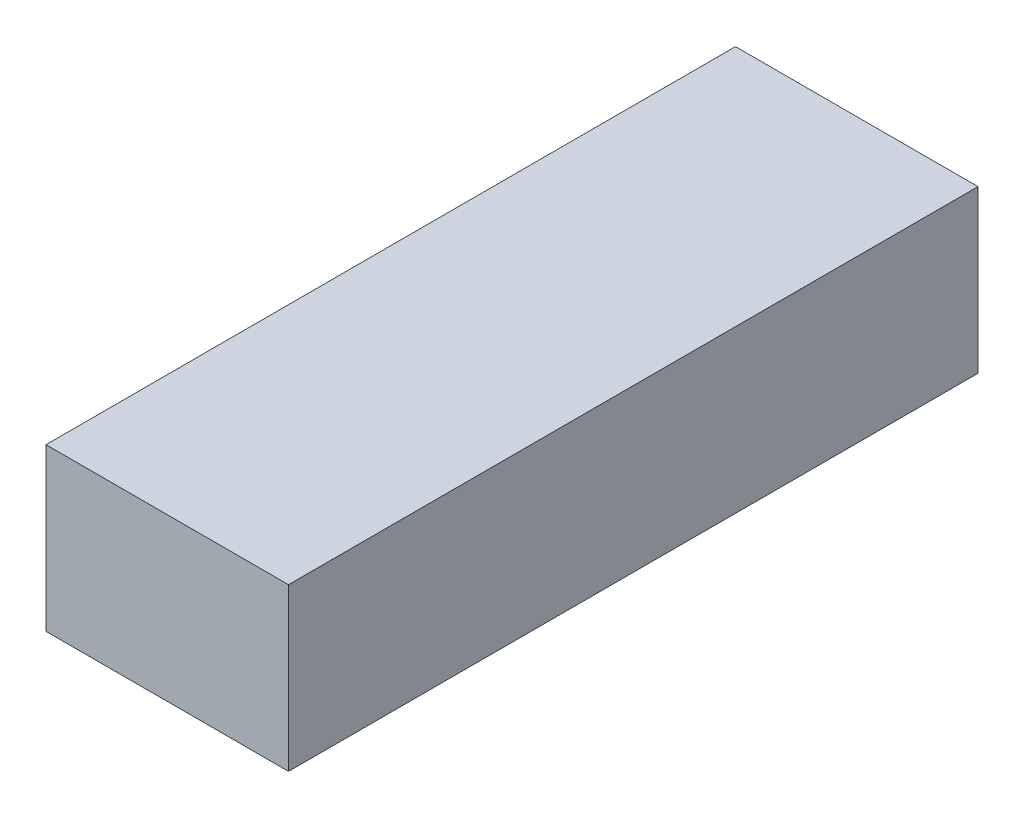
ISO-10303-21;
HEADER;
FILE_DESCRIPTION(('STEP AP214'),'2;1');
FILE_NAME('part.step','',(''),(''),'','','');
FILE_SCHEMA(('AUTOMOTIVE_DESIGN { 1 0 10303 214 1 1 1 1 }'));
ENDSEC;
DATA;
#1=APPLICATION_CONTEXT('core data for automotive mechanical design processes');
#2=APPLICATION_PROTOCOL_DEFINITION('international standard','automotive_design',2000,#1);
#3=PRODUCT_CONTEXT('',#1,'mechanical');
#4=PRODUCT('Part','Part','',(#3));
#5=PRODUCT_RELATED_PRODUCT_CATEGORY('part','',(#4));
#6=PRODUCT_DEFINITION_FORMATION('','',#4);
#7=PRODUCT_DEFINITION_CONTEXT('part definition',#1,'design');
#8=PRODUCT_DEFINITION('design','',#6,#7);
#9=PRODUCT_DEFINITION_SHAPE('','',#8);
#10=(LENGTH_UNIT() NAMED_UNIT(*) SI_UNIT(.MILLI.,.METRE.));
#11=(NAMED_UNIT(*) PLANE_ANGLE_UNIT() SI_UNIT($,.RADIAN.));
#12=(NAMED_UNIT(*) SI_UNIT($,.STERADIAN.) SOLID_ANGLE_UNIT());
#13=UNCERTAINTY_MEASURE_WITH_UNIT(LENGTH_MEASURE(1.E-05),#10,'distance_accuracy_value','');
#14=(GEOMETRIC_REPRESENTATION_CONTEXT(3) GLOBAL_UNCERTAINTY_ASSIGNED_CONTEXT((#13)) GLOBAL_UNIT_ASSIGNED_CONTEXT((#10,
#11,#12)) REPRESENTATION_CONTEXT('',''));
#15=CARTESIAN_POINT('',(0.,0.,0.));
#16=DIRECTION('',(0.,0.,1.));
#17=DIRECTION('',(1.,0.,0.));
#18=AXIS2_PLACEMENT_3D('',#15,#16,#17);
#19=CARTESIAN_POINT('',(25.5,-17.,145.));
#20=DIRECTION('',(-1.,0.,0.));
#21=DIRECTION('',(0.,0.,1.));
#22=AXIS2_PLACEMENT_3D('',#19,#20,#21);
#23=PLANE('',#22);
#24=DIRECTION('',(0.,1.,0.));
#25=VECTOR('',#24,1.);
#26=CARTESIAN_POINT('',(25.5,-17.,0.));
#27=LINE('',#26,#25);
#28=CARTESIAN_POINT('',(25.5,-17.,0.));
#29=VERTEX_POINT('',#28);
#30=CARTESIAN_POINT('',(25.5,17.,0.));
#31=VERTEX_POINT('',#30);
#32=EDGE_CURVE('E96',#29,#31,#27,.T.);
#33=ORIENTED_EDGE('',*,*,#32,.T.);
#34=DIRECTION('',(0.,0.,-1.));
#35=VECTOR('',#34,1.);
#36=CARTESIAN_POINT('',(25.5,17.,145.));
#37=LINE('',#36,#35);
#38=CARTESIAN_POINT('',(25.5,17.,145.));
#39=VERTEX_POINT('',#38);
#40=EDGE_CURVE('E11',#39,#31,#37,.T.);
#41=ORIENTED_EDGE('',*,*,#40,.F.);
#42=DIRECTION('',(0.,1.,0.));
#43=VECTOR('',#42,1.);
#44=CARTESIAN_POINT('',(25.5,-17.,145.));
#45=LINE('',#44,#43);
#46=CARTESIAN_POINT('',(25.5,-17.,145.));
#47=VERTEX_POINT('',#46);
#48=EDGE_CURVE('E84',#47,#39,#45,.T.);
#49=ORIENTED_EDGE('',*,*,#48,.F.);
#50=DIRECTION('',(0.,0.,-1.));
#51=VECTOR('',#50,1.);
#52=CARTESIAN_POINT('',(25.5,-17.,145.));
#53=LINE('',#52,#51);
#54=EDGE_CURVE('E92',#47,#29,#53,.T.);
#55=ORIENTED_EDGE('',*,*,#54,.T.);
#56=EDGE_LOOP('',(#33,#41,#49,#55));
#57=FACE_BOUND('',#56,.T.);
#58=ADVANCED_FACE('F33',(#57),#23,.F.);
#59=CARTESIAN_POINT('',(-25.5,17.,145.));
#60=DIRECTION('',(0.,-1.,0.));
#61=DIRECTION('',(0.,0.,-1.));
#62=AXIS2_PLACEMENT_3D('',#59,#60,#61);
#63=PLANE('',#62);
#64=DIRECTION('',(-1.,0.,0.));
#65=VECTOR('',#64,1.);
#66=CARTESIAN_POINT('',(-25.5,17.,0.));
#67=LINE('',#66,#65);
#68=CARTESIAN_POINT('',(-25.5,17.,0.));
#69=VERTEX_POINT('',#68);
#70=EDGE_CURVE('E88',#31,#69,#67,.T.);
#71=ORIENTED_EDGE('',*,*,#70,.T.);
#72=DIRECTION('',(0.,0.,-1.));
#73=VECTOR('',#72,1.);
#74=CARTESIAN_POINT('',(-25.5,17.,145.));
#75=LINE('',#74,#73);
#76=CARTESIAN_POINT('',(-25.5,17.,145.));
#77=VERTEX_POINT('',#76);
#78=EDGE_CURVE('E41',#77,#69,#75,.T.);
#79=ORIENTED_EDGE('',*,*,#78,.F.);
#80=DIRECTION('',(-1.,0.,0.));
#81=VECTOR('',#80,1.);
#82=CARTESIAN_POINT('',(-25.5,17.,145.));
#83=LINE('',#82,#81);
#84=EDGE_CURVE('E79',#39,#77,#83,.T.);
#85=ORIENTED_EDGE('',*,*,#84,.F.);
#86=ORIENTED_EDGE('',*,*,#40,.T.);
#87=EDGE_LOOP('',(#71,#79,#85,#86));
#88=FACE_BOUND('',#87,.T.);
#89=ADVANCED_FACE('F87',(#88),#63,.F.);
#90=CARTESIAN_POINT('',(-25.5,-17.,145.));
#91=DIRECTION('',(1.,0.,0.));
#92=DIRECTION('',(0.,0.,-1.));
#93=AXIS2_PLACEMENT_3D('',#90,#91,#92);
#94=PLANE('',#93);
#95=DIRECTION('',(0.,-1.,0.));
#96=VECTOR('',#95,1.);
#97=CARTESIAN_POINT('',(-25.5,-17.,0.));
#98=LINE('',#97,#96);
#99=CARTESIAN_POINT('',(-25.5,-17.,0.));
#100=VERTEX_POINT('',#99);
#101=EDGE_CURVE('E66',#69,#100,#98,.T.);
#102=ORIENTED_EDGE('',*,*,#101,.T.);
#103=DIRECTION('',(0.,0.,-1.));
#104=VECTOR('',#103,1.);
#105=CARTESIAN_POINT('',(-25.5,-17.,145.));
#106=LINE('',#105,#104);
#107=CARTESIAN_POINT('',(-25.5,-17.,145.));
#108=VERTEX_POINT('',#107);
#109=EDGE_CURVE('E89',#108,#100,#106,.T.);
#110=ORIENTED_EDGE('',*,*,#109,.F.);
#111=DIRECTION('',(0.,-1.,0.));
#112=VECTOR('',#111,1.);
#113=CARTESIAN_POINT('',(-25.5,-17.,145.));
#114=LINE('',#113,#112);
#115=EDGE_CURVE('E82',#77,#108,#114,.T.);
#116=ORIENTED_EDGE('',*,*,#115,.F.);
#117=ORIENTED_EDGE('',*,*,#78,.T.);
#118=EDGE_LOOP('',(#102,#110,#116,#117));
#119=FACE_BOUND('',#118,.T.);
#120=ADVANCED_FACE('F90',(#119),#94,.F.);
#121=CARTESIAN_POINT('',(-25.5,-17.,145.));
#122=DIRECTION('',(0.,1.,0.));
#123=DIRECTION('',(0.,0.,1.));
#124=AXIS2_PLACEMENT_3D('',#121,#122,#123);
#125=PLANE('',#124);
#126=DIRECTION('',(1.,0.,0.));
#127=VECTOR('',#126,1.);
#128=CARTESIAN_POINT('',(-25.5,-17.,0.));
#129=LINE('',#128,#127);
#130=EDGE_CURVE('E72',#100,#29,#129,.T.);
#131=ORIENTED_EDGE('',*,*,#130,.T.);
#132=ORIENTED_EDGE('',*,*,#54,.F.);
#133=DIRECTION('',(1.,0.,0.));
#134=VECTOR('',#133,1.);
#135=CARTESIAN_POINT('',(-25.5,-17.,145.));
#136=LINE('',#135,#134);
#137=EDGE_CURVE('E49',#108,#47,#136,.T.);
#138=ORIENTED_EDGE('',*,*,#137,.F.);
#139=ORIENTED_EDGE('',*,*,#109,.T.);
#140=EDGE_LOOP('',(#131,#132,#138,#139));
#141=FACE_BOUND('',#140,.T.);
#142=ADVANCED_FACE('F103',(#141),#125,.F.);
#143=CARTESIAN_POINT('',(0.,0.,145.));
#144=DIRECTION('',(0.,0.,-1.));
#145=DIRECTION('',(-1.,0.,0.));
#146=AXIS2_PLACEMENT_3D('',#143,#144,#145);
#147=PLANE('',#146);
#148=ORIENTED_EDGE('',*,*,#48,.T.);
#149=ORIENTED_EDGE('',*,*,#84,.T.);
#150=ORIENTED_EDGE('',*,*,#115,.T.);
#151=ORIENTED_EDGE('',*,*,#137,.T.);
#152=EDGE_LOOP('',(#148,#149,#150,#151));
#153=FACE_BOUND('',#152,.T.);
#154=ADVANCED_FACE('F80',(#153),#147,.F.);
#155=CARTESIAN_POINT('',(0.,0.,0.));
#156=DIRECTION('',(0.,0.,-1.));
#157=DIRECTION('',(-1.,0.,0.));
#158=AXIS2_PLACEMENT_3D('',#155,#156,#157);
#159=PLANE('',#158);
#160=ORIENTED_EDGE('',*,*,#32,.F.);
#161=ORIENTED_EDGE('',*,*,#130,.F.);
#162=ORIENTED_EDGE('',*,*,#101,.F.);
#163=ORIENTED_EDGE('',*,*,#70,.F.);
#164=EDGE_LOOP('',(#160,#161,#162,#163));
#165=FACE_BOUND('',#164,.T.);
#166=ADVANCED_FACE('F106',(#165),#159,.T.);
#167=CLOSED_SHELL('',(#58,#89,#120,#142,#154,#166));
#168=MANIFOLD_SOLID_BREP('B2',#167);
#169=ADVANCED_BREP_SHAPE_REPRESENTATION('',(#18,#168),#14);
#170=SHAPE_DEFINITION_REPRESENTATION(#9,#169);
ENDSEC;
END-ISO-10303-21;
